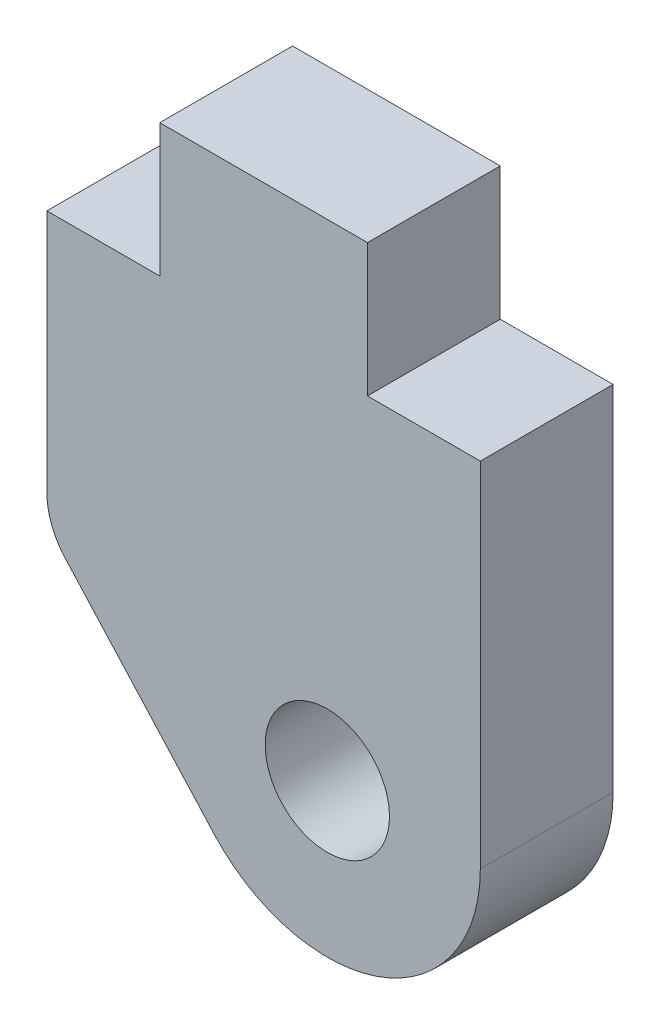
ISO-10303-21;
HEADER;
FILE_DESCRIPTION(('STEP AP214'),'2;1');
FILE_NAME('part.step','',(''),(''),'','','');
FILE_SCHEMA(('AUTOMOTIVE_DESIGN { 1 0 10303 214 1 1 1 1 }'));
ENDSEC;
DATA;
#1=APPLICATION_CONTEXT('core data for automotive mechanical design processes');
#2=APPLICATION_PROTOCOL_DEFINITION('international standard','automotive_design',2000,#1);
#3=PRODUCT_CONTEXT('',#1,'mechanical');
#4=PRODUCT('Part','Part','',(#3));
#5=PRODUCT_RELATED_PRODUCT_CATEGORY('part','',(#4));
#6=PRODUCT_DEFINITION_FORMATION('','',#4);
#7=PRODUCT_DEFINITION_CONTEXT('part definition',#1,'design');
#8=PRODUCT_DEFINITION('design','',#6,#7);
#9=PRODUCT_DEFINITION_SHAPE('','',#8);
#10=(LENGTH_UNIT() NAMED_UNIT(*) SI_UNIT(.MILLI.,.METRE.));
#11=(NAMED_UNIT(*) PLANE_ANGLE_UNIT() SI_UNIT($,.RADIAN.));
#12=(NAMED_UNIT(*) SI_UNIT($,.STERADIAN.) SOLID_ANGLE_UNIT());
#13=UNCERTAINTY_MEASURE_WITH_UNIT(LENGTH_MEASURE(1.E-05),#10,'distance_accuracy_value','');
#14=(GEOMETRIC_REPRESENTATION_CONTEXT(3) GLOBAL_UNCERTAINTY_ASSIGNED_CONTEXT((#13)) GLOBAL_UNIT_ASSIGNED_CONTEXT((#10,
#11,#12)) REPRESENTATION_CONTEXT('',''));
#15=CARTESIAN_POINT('',(0.,0.,0.));
#16=DIRECTION('',(0.,0.,1.));
#17=DIRECTION('',(1.,0.,0.));
#18=AXIS2_PLACEMENT_3D('',#15,#16,#17);
#19=CARTESIAN_POINT('',(-3.4925,-1.37545823877787,3.175));
#20=DIRECTION('',(0.,0.,1.));
#21=DIRECTION('',(1.,0.,0.));
#22=AXIS2_PLACEMENT_3D('',#19,#20,#21);
#23=PLANE('',#22);
#24=CARTESIAN_POINT('',(-3.4925,-1.37545823877787,3.175));
#25=DIRECTION('',(0.,0.,1.));
#26=DIRECTION('',(1.,0.,0.));
#27=AXIS2_PLACEMENT_3D('',#24,#25,#26);
#28=CIRCLE('',#27,1.6891);
#29=CARTESIAN_POINT('',(-5.1816,-1.37545823877787,3.175));
#30=VERTEX_POINT('',#29);
#31=CARTESIAN_POINT('',(-4.74438205865096,-2.50941155405493,3.175));
#32=VERTEX_POINT('',#31);
#33=EDGE_CURVE('E182',#30,#32,#28,.T.);
#34=ORIENTED_EDGE('',*,*,#33,.T.);
#35=DIRECTION('',(0.671335809174744,-0.741153311616221,0.));
#36=VECTOR('',#35,1.);
#37=CARTESIAN_POINT('',(-4.74438205865096,-2.50941155405493,3.175));
#38=LINE('',#37,#36);
#39=CARTESIAN_POINT('',(-1.18684235256749,-6.43692785563754,3.175));
#40=VERTEX_POINT('',#39);
#41=EDGE_CURVE('E106',#32,#40,#38,.T.);
#42=ORIENTED_EDGE('',*,*,#41,.T.);
#43=CARTESIAN_POINT('',(1.524,-3.98145,3.175));
#44=DIRECTION('',(0.,0.,1.));
#45=DIRECTION('',(1.,0.,0.));
#46=AXIS2_PLACEMENT_3D('',#43,#44,#45);
#47=CIRCLE('',#46,3.6576);
#48=CARTESIAN_POINT('',(5.1816,-3.98145,3.175));
#49=VERTEX_POINT('',#48);
#50=EDGE_CURVE('E211',#40,#49,#47,.T.);
#51=ORIENTED_EDGE('',*,*,#50,.T.);
#52=DIRECTION('',(0.,1.,0.));
#53=VECTOR('',#52,1.);
#54=CARTESIAN_POINT('',(5.1816,-3.98145,3.175));
#55=LINE('',#54,#53);
#56=CARTESIAN_POINT('',(5.1816,4.46405,3.175));
#57=VERTEX_POINT('',#56);
#58=EDGE_CURVE('E231',#49,#57,#55,.T.);
#59=ORIENTED_EDGE('',*,*,#58,.T.);
#60=DIRECTION('',(-1.,0.,0.));
#61=VECTOR('',#60,1.);
#62=CARTESIAN_POINT('',(5.1816,4.46405,3.175));
#63=LINE('',#62,#61);
#64=CARTESIAN_POINT('',(2.48285,4.46405,3.175));
#65=VERTEX_POINT('',#64);
#66=EDGE_CURVE('E227',#57,#65,#63,.T.);
#67=ORIENTED_EDGE('',*,*,#66,.T.);
#68=DIRECTION('',(0.,1.,0.));
#69=VECTOR('',#68,1.);
#70=CARTESIAN_POINT('',(2.48285,4.46405,3.175));
#71=LINE('',#70,#69);
#72=CARTESIAN_POINT('',(2.48285,7.63905,3.175));
#73=VERTEX_POINT('',#72);
#74=EDGE_CURVE('E230',#65,#73,#71,.T.);
#75=ORIENTED_EDGE('',*,*,#74,.T.);
#76=DIRECTION('',(-1.,0.,0.));
#77=VECTOR('',#76,1.);
#78=CARTESIAN_POINT('',(2.48285,7.63905,3.175));
#79=LINE('',#78,#77);
#80=CARTESIAN_POINT('',(-2.48285,7.63905,3.175));
#81=VERTEX_POINT('',#80);
#82=EDGE_CURVE('E131',#73,#81,#79,.T.);
#83=ORIENTED_EDGE('',*,*,#82,.T.);
#84=DIRECTION('',(0.,-1.,0.));
#85=VECTOR('',#84,1.);
#86=CARTESIAN_POINT('',(-2.48285,7.63905,3.175));
#87=LINE('',#86,#85);
#88=CARTESIAN_POINT('',(-2.48285,4.46405,3.175));
#89=VERTEX_POINT('',#88);
#90=EDGE_CURVE('E125',#81,#89,#87,.T.);
#91=ORIENTED_EDGE('',*,*,#90,.T.);
#92=DIRECTION('',(-1.,0.,0.));
#93=VECTOR('',#92,1.);
#94=CARTESIAN_POINT('',(-2.48285,4.46405,3.175));
#95=LINE('',#94,#93);
#96=CARTESIAN_POINT('',(-5.1816,4.46405,3.175));
#97=VERTEX_POINT('',#96);
#98=EDGE_CURVE('E129',#89,#97,#95,.T.);
#99=ORIENTED_EDGE('',*,*,#98,.T.);
#100=DIRECTION('',(0.,-1.,0.));
#101=VECTOR('',#100,1.);
#102=CARTESIAN_POINT('',(-5.1816,4.46405,3.175));
#103=LINE('',#102,#101);
#104=EDGE_CURVE('E57',#97,#30,#103,.T.);
#105=ORIENTED_EDGE('',*,*,#104,.T.);
#106=EDGE_LOOP('',(#34,#42,#51,#59,#67,#75,#83,#91,#99,#105));
#107=FACE_BOUND('',#106,.T.);
#108=CARTESIAN_POINT('',(1.524,-3.98145,3.175));
#109=DIRECTION('',(0.,0.,1.));
#110=DIRECTION('',(1.,0.,0.));
#111=AXIS2_PLACEMENT_3D('',#108,#109,#110);
#112=CIRCLE('',#111,1.4859);
#113=CARTESIAN_POINT('',(3.0099,-3.98145,3.175));
#114=VERTEX_POINT('',#113);
#115=EDGE_CURVE('E158',#114,#114,#112,.T.);
#116=ORIENTED_EDGE('',*,*,#115,.F.);
#117=EDGE_LOOP('',(#116));
#118=FACE_BOUND('',#117,.T.);
#119=ADVANCED_FACE('F39',(#107,#118),#23,.T.);
#120=CARTESIAN_POINT('',(-3.4925,-1.37545823877787,0.));
#121=DIRECTION('',(0.,0.,1.));
#122=DIRECTION('',(1.,0.,0.));
#123=AXIS2_PLACEMENT_3D('',#120,#121,#122);
#124=PLANE('',#123);
#125=CARTESIAN_POINT('',(-3.4925,-1.37545823877787,0.));
#126=DIRECTION('',(0.,0.,1.));
#127=DIRECTION('',(1.,0.,0.));
#128=AXIS2_PLACEMENT_3D('',#125,#126,#127);
#129=CIRCLE('',#128,1.6891);
#130=CARTESIAN_POINT('',(-5.1816,-1.37545823877787,0.));
#131=VERTEX_POINT('',#130);
#132=CARTESIAN_POINT('',(-4.74438205865096,-2.50941155405493,0.));
#133=VERTEX_POINT('',#132);
#134=EDGE_CURVE('E153',#131,#133,#129,.T.);
#135=ORIENTED_EDGE('',*,*,#134,.F.);
#136=DIRECTION('',(0.,-1.,0.));
#137=VECTOR('',#136,1.);
#138=CARTESIAN_POINT('',(-5.1816,4.46405,0.));
#139=LINE('',#138,#137);
#140=CARTESIAN_POINT('',(-5.1816,4.46405,0.));
#141=VERTEX_POINT('',#140);
#142=EDGE_CURVE('E98',#141,#131,#139,.T.);
#143=ORIENTED_EDGE('',*,*,#142,.F.);
#144=DIRECTION('',(-1.,0.,0.));
#145=VECTOR('',#144,1.);
#146=CARTESIAN_POINT('',(-2.48285,4.46405,0.));
#147=LINE('',#146,#145);
#148=CARTESIAN_POINT('',(-2.48285,4.46405,0.));
#149=VERTEX_POINT('',#148);
#150=EDGE_CURVE('E92',#149,#141,#147,.T.);
#151=ORIENTED_EDGE('',*,*,#150,.F.);
#152=DIRECTION('',(0.,-1.,0.));
#153=VECTOR('',#152,1.);
#154=CARTESIAN_POINT('',(-2.48285,7.63905,0.));
#155=LINE('',#154,#153);
#156=CARTESIAN_POINT('',(-2.48285,7.63905,0.));
#157=VERTEX_POINT('',#156);
#158=EDGE_CURVE('E140',#157,#149,#155,.T.);
#159=ORIENTED_EDGE('',*,*,#158,.F.);
#160=DIRECTION('',(-1.,0.,0.));
#161=VECTOR('',#160,1.);
#162=CARTESIAN_POINT('',(2.48285,7.63905,0.));
#163=LINE('',#162,#161);
#164=CARTESIAN_POINT('',(2.48285,7.63905,0.));
#165=VERTEX_POINT('',#164);
#166=EDGE_CURVE('E173',#165,#157,#163,.T.);
#167=ORIENTED_EDGE('',*,*,#166,.F.);
#168=DIRECTION('',(0.,1.,0.));
#169=VECTOR('',#168,1.);
#170=CARTESIAN_POINT('',(2.48285,4.46405,0.));
#171=LINE('',#170,#169);
#172=CARTESIAN_POINT('',(2.48285,4.46405,0.));
#173=VERTEX_POINT('',#172);
#174=EDGE_CURVE('E170',#173,#165,#171,.T.);
#175=ORIENTED_EDGE('',*,*,#174,.F.);
#176=DIRECTION('',(-1.,0.,0.));
#177=VECTOR('',#176,1.);
#178=CARTESIAN_POINT('',(5.1816,4.46405,0.));
#179=LINE('',#178,#177);
#180=CARTESIAN_POINT('',(5.1816,4.46405,0.));
#181=VERTEX_POINT('',#180);
#182=EDGE_CURVE('E167',#181,#173,#179,.T.);
#183=ORIENTED_EDGE('',*,*,#182,.F.);
#184=DIRECTION('',(0.,1.,0.));
#185=VECTOR('',#184,1.);
#186=CARTESIAN_POINT('',(5.1816,-3.98145,0.));
#187=LINE('',#186,#185);
#188=CARTESIAN_POINT('',(5.1816,-3.98145,0.));
#189=VERTEX_POINT('',#188);
#190=EDGE_CURVE('E164',#189,#181,#187,.T.);
#191=ORIENTED_EDGE('',*,*,#190,.F.);
#192=CARTESIAN_POINT('',(1.524,-3.98145,0.));
#193=DIRECTION('',(0.,0.,1.));
#194=DIRECTION('',(1.,0.,0.));
#195=AXIS2_PLACEMENT_3D('',#192,#193,#194);
#196=CIRCLE('',#195,3.6576);
#197=CARTESIAN_POINT('',(-1.18684235256749,-6.43692785563754,0.));
#198=VERTEX_POINT('',#197);
#199=EDGE_CURVE('E161',#198,#189,#196,.T.);
#200=ORIENTED_EDGE('',*,*,#199,.F.);
#201=DIRECTION('',(0.671335809174744,-0.741153311616221,0.));
#202=VECTOR('',#201,1.);
#203=CARTESIAN_POINT('',(-4.74438205865096,-2.50941155405493,0.));
#204=LINE('',#203,#202);
#205=EDGE_CURVE('E157',#133,#198,#204,.T.);
#206=ORIENTED_EDGE('',*,*,#205,.F.);
#207=EDGE_LOOP('',(#135,#143,#151,#159,#167,#175,#183,#191,#200,#206));
#208=FACE_BOUND('',#207,.T.);
#209=CARTESIAN_POINT('',(1.524,-3.98145,0.));
#210=DIRECTION('',(0.,0.,1.));
#211=DIRECTION('',(1.,0.,0.));
#212=AXIS2_PLACEMENT_3D('',#209,#210,#211);
#213=CIRCLE('',#212,1.4859);
#214=CARTESIAN_POINT('',(3.0099,-3.98145,0.));
#215=VERTEX_POINT('',#214);
#216=EDGE_CURVE('E245',#215,#215,#213,.T.);
#217=ORIENTED_EDGE('',*,*,#216,.T.);
#218=EDGE_LOOP('',(#217));
#219=FACE_BOUND('',#218,.T.);
#220=ADVANCED_FACE('F215',(#208,#219),#124,.F.);
#221=CARTESIAN_POINT('',(-3.4925,-1.37545823877787,3.175));
#222=DIRECTION('',(0.,0.,-1.));
#223=DIRECTION('',(-1.,0.,0.));
#224=AXIS2_PLACEMENT_3D('',#221,#222,#223);
#225=CYLINDRICAL_SURFACE('',#224,1.6891);
#226=ORIENTED_EDGE('',*,*,#134,.T.);
#227=DIRECTION('',(0.,0.,-1.));
#228=VECTOR('',#227,1.);
#229=CARTESIAN_POINT('',(-4.74438205865096,-2.50941155405493,3.175));
#230=LINE('',#229,#228);
#231=EDGE_CURVE('E11',#32,#133,#230,.T.);
#232=ORIENTED_EDGE('',*,*,#231,.F.);
#233=ORIENTED_EDGE('',*,*,#33,.F.);
#234=DIRECTION('',(0.,0.,-1.));
#235=VECTOR('',#234,1.);
#236=CARTESIAN_POINT('',(-5.1816,-1.37545823877787,3.175));
#237=LINE('',#236,#235);
#238=EDGE_CURVE('E149',#30,#131,#237,.T.);
#239=ORIENTED_EDGE('',*,*,#238,.T.);
#240=EDGE_LOOP('',(#226,#232,#233,#239));
#241=FACE_BOUND('',#240,.T.);
#242=ADVANCED_FACE('F41',(#241),#225,.T.);
#243=CARTESIAN_POINT('',(-4.74438205865096,-2.50941155405493,3.175));
#244=DIRECTION('',(0.741153311616221,0.671335809174744,0.));
#245=DIRECTION('',(-0.671335809174744,0.741153311616221,0.));
#246=AXIS2_PLACEMENT_3D('',#243,#244,#245);
#247=PLANE('',#246);
#248=ORIENTED_EDGE('',*,*,#205,.T.);
#249=DIRECTION('',(0.,0.,-1.));
#250=VECTOR('',#249,1.);
#251=CARTESIAN_POINT('',(-1.18684235256749,-6.43692785563754,3.175));
#252=LINE('',#251,#250);
#253=EDGE_CURVE('E49',#40,#198,#252,.T.);
#254=ORIENTED_EDGE('',*,*,#253,.F.);
#255=ORIENTED_EDGE('',*,*,#41,.F.);
#256=ORIENTED_EDGE('',*,*,#231,.T.);
#257=EDGE_LOOP('',(#248,#254,#255,#256));
#258=FACE_BOUND('',#257,.T.);
#259=ADVANCED_FACE('F283',(#258),#247,.F.);
#260=CARTESIAN_POINT('',(1.524,-3.98145,3.175));
#261=DIRECTION('',(0.,0.,-1.));
#262=DIRECTION('',(-1.,0.,0.));
#263=AXIS2_PLACEMENT_3D('',#260,#261,#262);
#264=CYLINDRICAL_SURFACE('',#263,3.6576);
#265=ORIENTED_EDGE('',*,*,#199,.T.);
#266=DIRECTION('',(0.,0.,-1.));
#267=VECTOR('',#266,1.);
#268=CARTESIAN_POINT('',(5.1816,-3.98145,3.175));
#269=LINE('',#268,#267);
#270=EDGE_CURVE('E201',#49,#189,#269,.T.);
#271=ORIENTED_EDGE('',*,*,#270,.F.);
#272=ORIENTED_EDGE('',*,*,#50,.F.);
#273=ORIENTED_EDGE('',*,*,#253,.T.);
#274=EDGE_LOOP('',(#265,#271,#272,#273));
#275=FACE_BOUND('',#274,.T.);
#276=ADVANCED_FACE('F209',(#275),#264,.T.);
#277=CARTESIAN_POINT('',(5.1816,-3.98145,3.175));
#278=DIRECTION('',(-1.,0.,0.));
#279=DIRECTION('',(0.,-1.,0.));
#280=AXIS2_PLACEMENT_3D('',#277,#278,#279);
#281=PLANE('',#280);
#282=ORIENTED_EDGE('',*,*,#190,.T.);
#283=DIRECTION('',(0.,0.,-1.));
#284=VECTOR('',#283,1.);
#285=CARTESIAN_POINT('',(5.1816,4.46405,3.175));
#286=LINE('',#285,#284);
#287=EDGE_CURVE('E197',#57,#181,#286,.T.);
#288=ORIENTED_EDGE('',*,*,#287,.F.);
#289=ORIENTED_EDGE('',*,*,#58,.F.);
#290=ORIENTED_EDGE('',*,*,#270,.T.);
#291=EDGE_LOOP('',(#282,#288,#289,#290));
#292=FACE_BOUND('',#291,.T.);
#293=ADVANCED_FACE('F221',(#292),#281,.F.);
#294=CARTESIAN_POINT('',(5.1816,4.46405,3.175));
#295=DIRECTION('',(0.,-1.,0.));
#296=DIRECTION('',(1.,0.,0.));
#297=AXIS2_PLACEMENT_3D('',#294,#295,#296);
#298=PLANE('',#297);
#299=ORIENTED_EDGE('',*,*,#182,.T.);
#300=DIRECTION('',(0.,0.,-1.));
#301=VECTOR('',#300,1.);
#302=CARTESIAN_POINT('',(2.48285,4.46405,3.175));
#303=LINE('',#302,#301);
#304=EDGE_CURVE('E193',#65,#173,#303,.T.);
#305=ORIENTED_EDGE('',*,*,#304,.F.);
#306=ORIENTED_EDGE('',*,*,#66,.F.);
#307=ORIENTED_EDGE('',*,*,#287,.T.);
#308=EDGE_LOOP('',(#299,#305,#306,#307));
#309=FACE_BOUND('',#308,.T.);
#310=ADVANCED_FACE('F225',(#309),#298,.F.);
#311=CARTESIAN_POINT('',(2.48285,4.46405,3.175));
#312=DIRECTION('',(-1.,0.,0.));
#313=DIRECTION('',(0.,0.,1.));
#314=AXIS2_PLACEMENT_3D('',#311,#312,#313);
#315=PLANE('',#314);
#316=ORIENTED_EDGE('',*,*,#174,.T.);
#317=DIRECTION('',(0.,0.,-1.));
#318=VECTOR('',#317,1.);
#319=CARTESIAN_POINT('',(2.48285,7.63905,3.175));
#320=LINE('',#319,#318);
#321=EDGE_CURVE('E189',#73,#165,#320,.T.);
#322=ORIENTED_EDGE('',*,*,#321,.F.);
#323=ORIENTED_EDGE('',*,*,#74,.F.);
#324=ORIENTED_EDGE('',*,*,#304,.T.);
#325=EDGE_LOOP('',(#316,#322,#323,#324));
#326=FACE_BOUND('',#325,.T.);
#327=ADVANCED_FACE('F273',(#326),#315,.F.);
#328=CARTESIAN_POINT('',(2.48285,7.63905,3.175));
#329=DIRECTION('',(0.,-1.,0.));
#330=DIRECTION('',(0.,0.,-1.));
#331=AXIS2_PLACEMENT_3D('',#328,#329,#330);
#332=PLANE('',#331);
#333=ORIENTED_EDGE('',*,*,#166,.T.);
#334=DIRECTION('',(0.,0.,-1.));
#335=VECTOR('',#334,1.);
#336=CARTESIAN_POINT('',(-2.48285,7.63905,3.175));
#337=LINE('',#336,#335);
#338=EDGE_CURVE('E142',#81,#157,#337,.T.);
#339=ORIENTED_EDGE('',*,*,#338,.F.);
#340=ORIENTED_EDGE('',*,*,#82,.F.);
#341=ORIENTED_EDGE('',*,*,#321,.T.);
#342=EDGE_LOOP('',(#333,#339,#340,#341));
#343=FACE_BOUND('',#342,.T.);
#344=ADVANCED_FACE('F270',(#343),#332,.F.);
#345=CARTESIAN_POINT('',(-2.48285,7.63905,3.175));
#346=DIRECTION('',(1.,0.,0.));
#347=DIRECTION('',(0.,0.,-1.));
#348=AXIS2_PLACEMENT_3D('',#345,#346,#347);
#349=PLANE('',#348);
#350=ORIENTED_EDGE('',*,*,#158,.T.);
#351=DIRECTION('',(0.,0.,-1.));
#352=VECTOR('',#351,1.);
#353=CARTESIAN_POINT('',(-2.48285,4.46405,3.175));
#354=LINE('',#353,#352);
#355=EDGE_CURVE('E137',#89,#149,#354,.T.);
#356=ORIENTED_EDGE('',*,*,#355,.F.);
#357=ORIENTED_EDGE('',*,*,#90,.F.);
#358=ORIENTED_EDGE('',*,*,#338,.T.);
#359=EDGE_LOOP('',(#350,#356,#357,#358));
#360=FACE_BOUND('',#359,.T.);
#361=ADVANCED_FACE('F138',(#360),#349,.F.);
#362=CARTESIAN_POINT('',(-2.48285,4.46405,3.175));
#363=DIRECTION('',(0.,-1.,0.));
#364=DIRECTION('',(0.,0.,-1.));
#365=AXIS2_PLACEMENT_3D('',#362,#363,#364);
#366=PLANE('',#365);
#367=ORIENTED_EDGE('',*,*,#150,.T.);
#368=DIRECTION('',(0.,0.,-1.));
#369=VECTOR('',#368,1.);
#370=CARTESIAN_POINT('',(-5.1816,4.46405,3.175));
#371=LINE('',#370,#369);
#372=EDGE_CURVE('E143',#97,#141,#371,.T.);
#373=ORIENTED_EDGE('',*,*,#372,.F.);
#374=ORIENTED_EDGE('',*,*,#98,.F.);
#375=ORIENTED_EDGE('',*,*,#355,.T.);
#376=EDGE_LOOP('',(#367,#373,#374,#375));
#377=FACE_BOUND('',#376,.T.);
#378=ADVANCED_FACE('F145',(#377),#366,.F.);
#379=CARTESIAN_POINT('',(-5.1816,4.46405,3.175));
#380=DIRECTION('',(1.,0.,0.));
#381=DIRECTION('',(0.,1.,0.));
#382=AXIS2_PLACEMENT_3D('',#379,#380,#381);
#383=PLANE('',#382);
#384=ORIENTED_EDGE('',*,*,#142,.T.);
#385=ORIENTED_EDGE('',*,*,#238,.F.);
#386=ORIENTED_EDGE('',*,*,#104,.F.);
#387=ORIENTED_EDGE('',*,*,#372,.T.);
#388=EDGE_LOOP('',(#384,#385,#386,#387));
#389=FACE_BOUND('',#388,.T.);
#390=ADVANCED_FACE('F263',(#389),#383,.F.);
#391=CARTESIAN_POINT('',(1.524,-3.98145,3.175));
#392=DIRECTION('',(0.,0.,-1.));
#393=DIRECTION('',(-1.,0.,0.));
#394=AXIS2_PLACEMENT_3D('',#391,#392,#393);
#395=CYLINDRICAL_SURFACE('',#394,1.4859);
#396=ORIENTED_EDGE('',*,*,#115,.T.);
#397=EDGE_LOOP('',(#396));
#398=FACE_BOUND('',#397,.T.);
#399=ORIENTED_EDGE('',*,*,#216,.F.);
#400=EDGE_LOOP('',(#399));
#401=FACE_BOUND('',#400,.T.);
#402=ADVANCED_FACE('F253',(#398,#401),#395,.F.);
#403=CLOSED_SHELL('',(#119,#220,#242,#259,#276,#293,#310,#327,#344,#361,#378,#390,#402));
#404=MANIFOLD_SOLID_BREP('B2',#403);
#405=ADVANCED_BREP_SHAPE_REPRESENTATION('',(#18,#404),#14);
#406=SHAPE_DEFINITION_REPRESENTATION(#9,#405);
ENDSEC;
END-ISO-10303-21;
